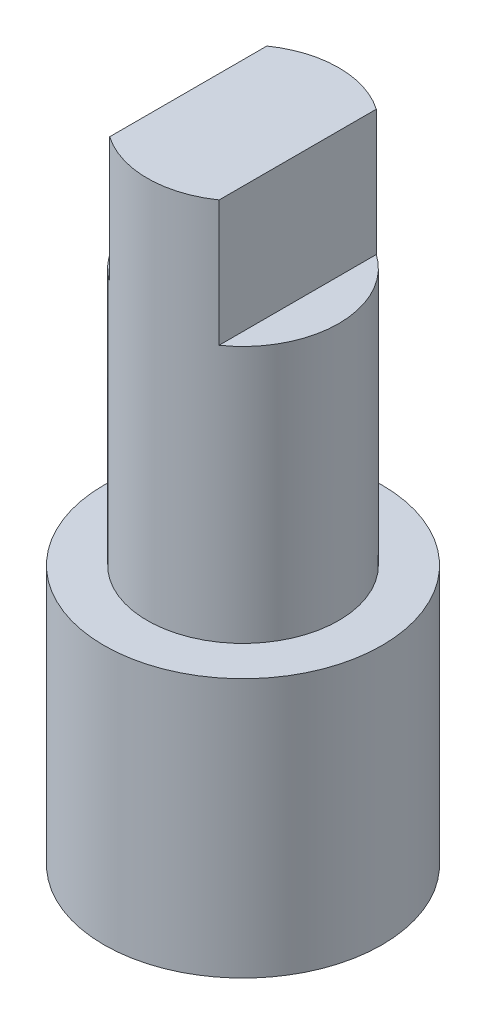
ISO-10303-21;
HEADER;
FILE_DESCRIPTION(('STEP AP214'),'2;1');
FILE_NAME('part.step','',(''),(''),'','','');
FILE_SCHEMA(('AUTOMOTIVE_DESIGN { 1 0 10303 214 1 1 1 1 }'));
ENDSEC;
DATA;
#1=APPLICATION_CONTEXT('core data for automotive mechanical design processes');
#2=APPLICATION_PROTOCOL_DEFINITION('international standard','automotive_design',2000,#1);
#3=PRODUCT_CONTEXT('',#1,'mechanical');
#4=PRODUCT('Part','Part','',(#3));
#5=PRODUCT_RELATED_PRODUCT_CATEGORY('part','',(#4));
#6=PRODUCT_DEFINITION_FORMATION('','',#4);
#7=PRODUCT_DEFINITION_CONTEXT('part definition',#1,'design');
#8=PRODUCT_DEFINITION('design','',#6,#7);
#9=PRODUCT_DEFINITION_SHAPE('','',#8);
#10=(LENGTH_UNIT() NAMED_UNIT(*) SI_UNIT(.MILLI.,.METRE.));
#11=(NAMED_UNIT(*) PLANE_ANGLE_UNIT() SI_UNIT($,.RADIAN.));
#12=(NAMED_UNIT(*) SI_UNIT($,.STERADIAN.) SOLID_ANGLE_UNIT());
#13=UNCERTAINTY_MEASURE_WITH_UNIT(LENGTH_MEASURE(1.E-05),#10,'distance_accuracy_value','');
#14=(GEOMETRIC_REPRESENTATION_CONTEXT(3) GLOBAL_UNCERTAINTY_ASSIGNED_CONTEXT((#13)) GLOBAL_UNIT_ASSIGNED_CONTEXT((#10,
#11,#12)) REPRESENTATION_CONTEXT('',''));
#15=CARTESIAN_POINT('',(0.,0.,0.));
#16=DIRECTION('',(0.,0.,1.));
#17=DIRECTION('',(1.,0.,0.));
#18=AXIS2_PLACEMENT_3D('',#15,#16,#17);
#19=CARTESIAN_POINT('',(0.,11.738,0.));
#20=DIRECTION('',(0.,-1.,0.));
#21=DIRECTION('',(0.,0.,-1.));
#22=AXIS2_PLACEMENT_3D('',#19,#20,#21);
#23=CYLINDRICAL_SURFACE('',#22,1.75);
#24=DIRECTION('',(0.,1.,0.));
#25=VECTOR('',#24,1.);
#26=CARTESIAN_POINT('',(-1.,9.438,-1.43614066163451));
#27=LINE('',#26,#25);
#28=CARTESIAN_POINT('',(-1.,9.438,-1.43614066163451));
#29=VERTEX_POINT('',#28);
#30=CARTESIAN_POINT('',(-1.,11.738,-1.43614066163451));
#31=VERTEX_POINT('',#30);
#32=EDGE_CURVE('E72',#29,#31,#27,.T.);
#33=ORIENTED_EDGE('',*,*,#32,.T.);
#34=CARTESIAN_POINT('',(0.,11.738,0.));
#35=DIRECTION('',(0.,1.,0.));
#36=DIRECTION('',(0.,0.,1.));
#37=AXIS2_PLACEMENT_3D('',#34,#35,#36);
#38=CIRCLE('',#37,1.75);
#39=CARTESIAN_POINT('',(1.,11.738,-1.43614066163451));
#40=VERTEX_POINT('',#39);
#41=EDGE_CURVE('E40',#40,#31,#38,.T.);
#42=ORIENTED_EDGE('',*,*,#41,.F.);
#43=DIRECTION('',(0.,1.,0.));
#44=VECTOR('',#43,1.);
#45=CARTESIAN_POINT('',(1.,9.438,-1.43614066163451));
#46=LINE('',#45,#44);
#47=CARTESIAN_POINT('',(1.,9.438,-1.43614066163451));
#48=VERTEX_POINT('',#47);
#49=EDGE_CURVE('E55',#48,#40,#46,.T.);
#50=ORIENTED_EDGE('',*,*,#49,.F.);
#51=CARTESIAN_POINT('',(0.,9.438,0.));
#52=DIRECTION('',(0.,1.,0.));
#53=DIRECTION('',(0.,0.,1.));
#54=AXIS2_PLACEMENT_3D('',#51,#52,#53);
#55=CIRCLE('',#54,1.75);
#56=CARTESIAN_POINT('',(1.,9.438,1.43614066163451));
#57=VERTEX_POINT('',#56);
#58=EDGE_CURVE('E96',#57,#48,#55,.T.);
#59=ORIENTED_EDGE('',*,*,#58,.F.);
#60=DIRECTION('',(0.,1.,0.));
#61=VECTOR('',#60,1.);
#62=CARTESIAN_POINT('',(1.,9.438,1.43614066163451));
#63=LINE('',#62,#61);
#64=CARTESIAN_POINT('',(1.,11.738,1.43614066163451));
#65=VERTEX_POINT('',#64);
#66=EDGE_CURVE('E93',#57,#65,#63,.T.);
#67=ORIENTED_EDGE('',*,*,#66,.T.);
#68=CARTESIAN_POINT('',(-1.,11.738,1.43614066163451));
#69=VERTEX_POINT('',#68);
#70=EDGE_CURVE('E94',#69,#65,#38,.T.);
#71=ORIENTED_EDGE('',*,*,#70,.F.);
#72=DIRECTION('',(0.,1.,0.));
#73=VECTOR('',#72,1.);
#74=CARTESIAN_POINT('',(-1.,9.438,1.43614066163451));
#75=LINE('',#74,#73);
#76=CARTESIAN_POINT('',(-1.,9.438,1.43614066163451));
#77=VERTEX_POINT('',#76);
#78=EDGE_CURVE('E47',#77,#69,#75,.T.);
#79=ORIENTED_EDGE('',*,*,#78,.F.);
#80=CARTESIAN_POINT('',(0.,9.438,0.));
#81=DIRECTION('',(0.,1.,0.));
#82=DIRECTION('',(0.,0.,1.));
#83=AXIS2_PLACEMENT_3D('',#80,#81,#82);
#84=CIRCLE('',#83,1.75);
#85=EDGE_CURVE('E82',#29,#77,#84,.T.);
#86=ORIENTED_EDGE('',*,*,#85,.F.);
#87=EDGE_LOOP('',(#33,#42,#50,#59,#67,#71,#79,#86));
#88=FACE_BOUND('',#87,.T.);
#89=CARTESIAN_POINT('',(0.,4.738,0.));
#90=DIRECTION('',(0.,-1.,0.));
#91=DIRECTION('',(0.,0.,-1.));
#92=AXIS2_PLACEMENT_3D('',#89,#90,#91);
#93=CIRCLE('',#92,1.75);
#94=CARTESIAN_POINT('',(0.,4.738,-1.75));
#95=VERTEX_POINT('',#94);
#96=EDGE_CURVE('E11',#95,#95,#93,.T.);
#97=ORIENTED_EDGE('',*,*,#96,.F.);
#98=EDGE_LOOP('',(#97));
#99=FACE_BOUND('',#98,.T.);
#100=ADVANCED_FACE('F33',(#88,#99),#23,.T.);
#101=CARTESIAN_POINT('',(0.,11.738,0.));
#102=DIRECTION('',(0.,1.,0.));
#103=DIRECTION('',(0.,0.,1.));
#104=AXIS2_PLACEMENT_3D('',#101,#102,#103);
#105=PLANE('',#104);
#106=ORIENTED_EDGE('',*,*,#41,.T.);
#107=DIRECTION('',(0.,0.,1.));
#108=VECTOR('',#107,1.);
#109=CARTESIAN_POINT('',(-1.,11.738,0.));
#110=LINE('',#109,#108);
#111=EDGE_CURVE('E77',#31,#69,#110,.T.);
#112=ORIENTED_EDGE('',*,*,#111,.T.);
#113=ORIENTED_EDGE('',*,*,#70,.T.);
#114=DIRECTION('',(0.,0.,1.));
#115=VECTOR('',#114,1.);
#116=CARTESIAN_POINT('',(1.,11.738,0.));
#117=LINE('',#116,#115);
#118=EDGE_CURVE('E99',#40,#65,#117,.T.);
#119=ORIENTED_EDGE('',*,*,#118,.F.);
#120=EDGE_LOOP('',(#106,#112,#113,#119));
#121=FACE_BOUND('',#120,.T.);
#122=ADVANCED_FACE('F108',(#121),#105,.T.);
#123=CARTESIAN_POINT('',(1.,9.438,0.));
#124=DIRECTION('',(-1.,0.,0.));
#125=DIRECTION('',(0.,0.,1.));
#126=AXIS2_PLACEMENT_3D('',#123,#124,#125);
#127=PLANE('',#126);
#128=ORIENTED_EDGE('',*,*,#118,.T.);
#129=ORIENTED_EDGE('',*,*,#66,.F.);
#130=DIRECTION('',(0.,0.,1.));
#131=VECTOR('',#130,1.);
#132=CARTESIAN_POINT('',(1.,9.438,0.));
#133=LINE('',#132,#131);
#134=EDGE_CURVE('E98',#48,#57,#133,.T.);
#135=ORIENTED_EDGE('',*,*,#134,.F.);
#136=ORIENTED_EDGE('',*,*,#49,.T.);
#137=EDGE_LOOP('',(#128,#129,#135,#136));
#138=FACE_BOUND('',#137,.T.);
#139=ADVANCED_FACE('F112',(#138),#127,.F.);
#140=CARTESIAN_POINT('',(0.,9.438,0.));
#141=DIRECTION('',(0.,1.,0.));
#142=DIRECTION('',(0.,0.,1.));
#143=AXIS2_PLACEMENT_3D('',#140,#141,#142);
#144=PLANE('',#143);
#145=ORIENTED_EDGE('',*,*,#58,.T.);
#146=ORIENTED_EDGE('',*,*,#134,.T.);
#147=EDGE_LOOP('',(#145,#146));
#148=FACE_BOUND('',#147,.T.);
#149=ADVANCED_FACE('F111',(#148),#144,.T.);
#150=CARTESIAN_POINT('',(-1.,9.438,0.));
#151=DIRECTION('',(-1.,0.,0.));
#152=DIRECTION('',(0.,0.,1.));
#153=AXIS2_PLACEMENT_3D('',#150,#151,#152);
#154=PLANE('',#153);
#155=ORIENTED_EDGE('',*,*,#111,.F.);
#156=ORIENTED_EDGE('',*,*,#32,.F.);
#157=DIRECTION('',(0.,0.,1.));
#158=VECTOR('',#157,1.);
#159=CARTESIAN_POINT('',(-1.,9.438,0.));
#160=LINE('',#159,#158);
#161=EDGE_CURVE('E75',#29,#77,#160,.T.);
#162=ORIENTED_EDGE('',*,*,#161,.T.);
#163=ORIENTED_EDGE('',*,*,#78,.T.);
#164=EDGE_LOOP('',(#155,#156,#162,#163));
#165=FACE_BOUND('',#164,.T.);
#166=ADVANCED_FACE('F74',(#165),#154,.T.);
#167=CARTESIAN_POINT('',(0.,9.438,0.));
#168=DIRECTION('',(0.,1.,0.));
#169=DIRECTION('',(0.,0.,1.));
#170=AXIS2_PLACEMENT_3D('',#167,#168,#169);
#171=PLANE('',#170);
#172=ORIENTED_EDGE('',*,*,#161,.F.);
#173=ORIENTED_EDGE('',*,*,#85,.T.);
#174=EDGE_LOOP('',(#172,#173));
#175=FACE_BOUND('',#174,.T.);
#176=ADVANCED_FACE('F85',(#175),#171,.T.);
#177=CARTESIAN_POINT('',(0.,4.738,0.));
#178=DIRECTION('',(0.,-1.,0.));
#179=DIRECTION('',(0.,0.,-1.));
#180=AXIS2_PLACEMENT_3D('',#177,#178,#179);
#181=CYLINDRICAL_SURFACE('',#180,2.54);
#182=CARTESIAN_POINT('',(0.,4.738,0.));
#183=DIRECTION('',(0.,-1.,0.));
#184=DIRECTION('',(0.,0.,-1.));
#185=AXIS2_PLACEMENT_3D('',#182,#183,#184);
#186=CIRCLE('',#185,2.54);
#187=CARTESIAN_POINT('',(0.,4.738,-2.54));
#188=VERTEX_POINT('',#187);
#189=EDGE_CURVE('E103',#188,#188,#186,.T.);
#190=ORIENTED_EDGE('',*,*,#189,.T.);
#191=EDGE_LOOP('',(#190));
#192=FACE_BOUND('',#191,.T.);
#193=CARTESIAN_POINT('',(0.,0.,0.));
#194=DIRECTION('',(0.,-1.,0.));
#195=DIRECTION('',(0.,0.,-1.));
#196=AXIS2_PLACEMENT_3D('',#193,#194,#195);
#197=CIRCLE('',#196,2.54);
#198=CARTESIAN_POINT('',(0.,0.,-2.54));
#199=VERTEX_POINT('',#198);
#200=EDGE_CURVE('E194',#199,#199,#197,.T.);
#201=ORIENTED_EDGE('',*,*,#200,.F.);
#202=EDGE_LOOP('',(#201));
#203=FACE_BOUND('',#202,.T.);
#204=ADVANCED_FACE('F156',(#192,#203),#181,.T.);
#205=CARTESIAN_POINT('',(0.,4.738,0.));
#206=DIRECTION('',(0.,-1.,0.));
#207=DIRECTION('',(0.,0.,-1.));
#208=AXIS2_PLACEMENT_3D('',#205,#206,#207);
#209=PLANE('',#208);
#210=ORIENTED_EDGE('',*,*,#96,.T.);
#211=EDGE_LOOP('',(#210));
#212=FACE_BOUND('',#211,.T.);
#213=ORIENTED_EDGE('',*,*,#189,.F.);
#214=EDGE_LOOP('',(#213));
#215=FACE_BOUND('',#214,.T.);
#216=ADVANCED_FACE('F164',(#212,#215),#209,.F.);
#217=CARTESIAN_POINT('',(0.,0.,0.));
#218=DIRECTION('',(0.,1.,0.));
#219=DIRECTION('',(0.,0.,1.));
#220=AXIS2_PLACEMENT_3D('',#217,#218,#219);
#221=PLANE('',#220);
#222=ORIENTED_EDGE('',*,*,#200,.T.);
#223=EDGE_LOOP('',(#222));
#224=FACE_BOUND('',#223,.T.);
#225=ADVANCED_FACE('F172',(#224),#221,.F.);
#226=CLOSED_SHELL('',(#100,#122,#139,#149,#166,#176,#204,#216,#225));
#227=MANIFOLD_SOLID_BREP('B2',#226);
#228=ADVANCED_BREP_SHAPE_REPRESENTATION('',(#18,#227),#14);
#229=SHAPE_DEFINITION_REPRESENTATION(#9,#228);
ENDSEC;
END-ISO-10303-21;
